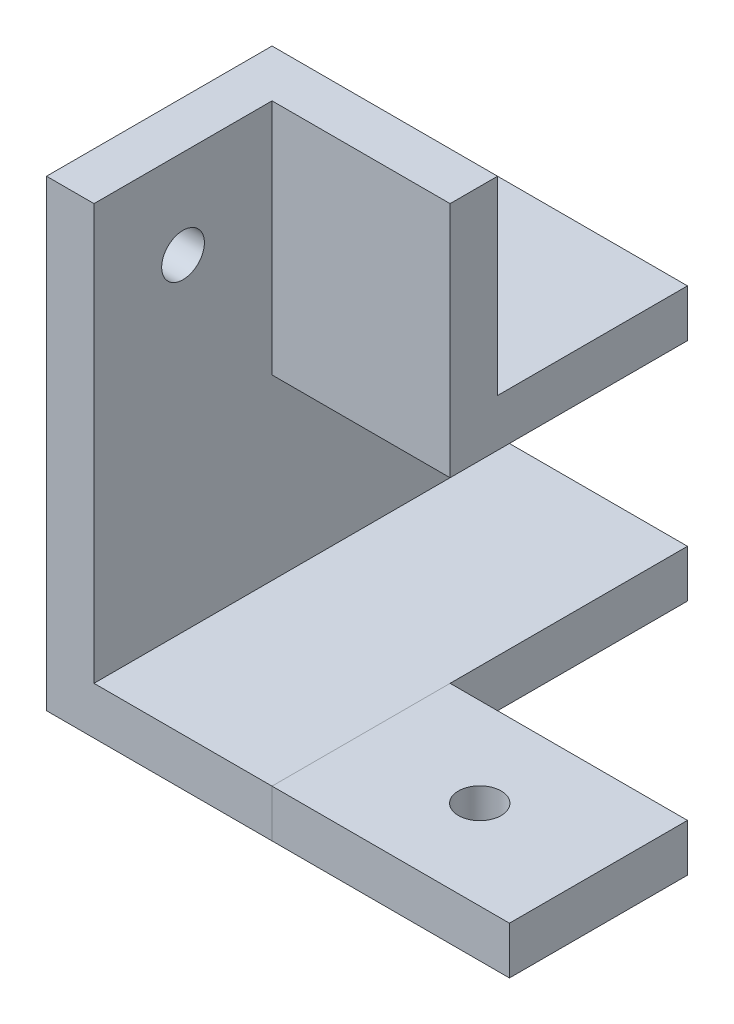
ISO-10303-21;
HEADER;
FILE_DESCRIPTION(('STEP AP214'),'2;1');
FILE_NAME('part.step','',(''),(''),'','','');
FILE_SCHEMA(('AUTOMOTIVE_DESIGN { 1 0 10303 214 1 1 1 1 }'));
ENDSEC;
DATA;
#1=APPLICATION_CONTEXT('core data for automotive mechanical design processes');
#2=APPLICATION_PROTOCOL_DEFINITION('international standard','automotive_design',2000,#1);
#3=PRODUCT_CONTEXT('',#1,'mechanical');
#4=PRODUCT('Part','Part','',(#3));
#5=PRODUCT_RELATED_PRODUCT_CATEGORY('part','',(#4));
#6=PRODUCT_DEFINITION_FORMATION('','',#4);
#7=PRODUCT_DEFINITION_CONTEXT('part definition',#1,'design');
#8=PRODUCT_DEFINITION('design','',#6,#7);
#9=PRODUCT_DEFINITION_SHAPE('','',#8);
#10=(LENGTH_UNIT() NAMED_UNIT(*) SI_UNIT(.MILLI.,.METRE.));
#11=(NAMED_UNIT(*) PLANE_ANGLE_UNIT() SI_UNIT($,.RADIAN.));
#12=(NAMED_UNIT(*) SI_UNIT($,.STERADIAN.) SOLID_ANGLE_UNIT());
#13=UNCERTAINTY_MEASURE_WITH_UNIT(LENGTH_MEASURE(1.E-05),#10,'distance_accuracy_value','');
#14=(GEOMETRIC_REPRESENTATION_CONTEXT(3) GLOBAL_UNCERTAINTY_ASSIGNED_CONTEXT((#13)) GLOBAL_UNIT_ASSIGNED_CONTEXT((#10,
#11,#12)) REPRESENTATION_CONTEXT('',''));
#15=CARTESIAN_POINT('',(0.,0.,0.));
#16=DIRECTION('',(0.,0.,1.));
#17=DIRECTION('',(1.,0.,0.));
#18=AXIS2_PLACEMENT_3D('',#15,#16,#17);
#19=CARTESIAN_POINT('',(35.,0.,0.));
#20=DIRECTION('',(0.,1.,0.));
#21=DIRECTION('',(0.,0.,1.));
#22=AXIS2_PLACEMENT_3D('',#19,#20,#21);
#23=PLANE('',#22);
#24=CARTESIAN_POINT('',(25.,0.,7.5));
#25=DIRECTION('',(0.,-1.,0.));
#26=DIRECTION('',(0.,0.,-1.));
#27=AXIS2_PLACEMENT_3D('',#24,#25,#26);
#28=CIRCLE('',#27,1.8);
#29=CARTESIAN_POINT('',(25.,0.,5.7));
#30=VERTEX_POINT('',#29);
#31=EDGE_CURVE('E106',#30,#30,#28,.T.);
#32=ORIENTED_EDGE('',*,*,#31,.F.);
#33=EDGE_LOOP('',(#32));
#34=FACE_BOUND('',#33,.T.);
#35=DIRECTION('',(0.,0.,-1.));
#36=VECTOR('',#35,1.);
#37=CARTESIAN_POINT('',(35.,0.,0.));
#38=LINE('',#37,#36);
#39=CARTESIAN_POINT('',(35.,0.,15.));
#40=VERTEX_POINT('',#39);
#41=CARTESIAN_POINT('',(35.,0.,0.));
#42=VERTEX_POINT('',#41);
#43=EDGE_CURVE('E95',#40,#42,#38,.T.);
#44=ORIENTED_EDGE('',*,*,#43,.F.);
#45=DIRECTION('',(1.,0.,0.));
#46=VECTOR('',#45,1.);
#47=CARTESIAN_POINT('',(35.,0.,15.));
#48=LINE('',#47,#46);
#49=CARTESIAN_POINT('',(15.,0.,15.));
#50=VERTEX_POINT('',#49);
#51=EDGE_CURVE('E85',#50,#40,#48,.T.);
#52=ORIENTED_EDGE('',*,*,#51,.F.);
#53=DIRECTION('',(0.,0.,-1.));
#54=VECTOR('',#53,1.);
#55=CARTESIAN_POINT('',(15.,0.,0.));
#56=LINE('',#55,#54);
#57=CARTESIAN_POINT('',(15.,0.,0.));
#58=VERTEX_POINT('',#57);
#59=EDGE_CURVE('E68',#50,#58,#56,.T.);
#60=ORIENTED_EDGE('',*,*,#59,.T.);
#61=DIRECTION('',(1.,0.,0.));
#62=VECTOR('',#61,1.);
#63=CARTESIAN_POINT('',(15.,0.,0.));
#64=LINE('',#63,#62);
#65=EDGE_CURVE('E99',#58,#42,#64,.T.);
#66=ORIENTED_EDGE('',*,*,#65,.T.);
#67=EDGE_LOOP('',(#44,#52,#60,#66));
#68=FACE_BOUND('',#67,.T.);
#69=ADVANCED_FACE('F47',(#34,#68),#23,.F.);
#70=CARTESIAN_POINT('',(35.,4.,0.));
#71=DIRECTION('',(0.,-1.,0.));
#72=DIRECTION('',(0.,0.,-1.));
#73=AXIS2_PLACEMENT_3D('',#70,#71,#72);
#74=PLANE('',#73);
#75=CARTESIAN_POINT('',(25.,4.,7.5));
#76=DIRECTION('',(0.,-1.,0.));
#77=DIRECTION('',(0.,0.,-1.));
#78=AXIS2_PLACEMENT_3D('',#75,#76,#77);
#79=CIRCLE('',#78,1.8);
#80=CARTESIAN_POINT('',(25.,4.,5.7));
#81=VERTEX_POINT('',#80);
#82=EDGE_CURVE('E109',#81,#81,#79,.T.);
#83=ORIENTED_EDGE('',*,*,#82,.T.);
#84=EDGE_LOOP('',(#83));
#85=FACE_BOUND('',#84,.T.);
#86=DIRECTION('',(0.,0.,1.));
#87=VECTOR('',#86,1.);
#88=CARTESIAN_POINT('',(15.,4.,0.));
#89=LINE('',#88,#87);
#90=CARTESIAN_POINT('',(15.,4.,0.));
#91=VERTEX_POINT('',#90);
#92=CARTESIAN_POINT('',(15.,4.,15.));
#93=VERTEX_POINT('',#92);
#94=EDGE_CURVE('E100',#91,#93,#89,.T.);
#95=ORIENTED_EDGE('',*,*,#94,.T.);
#96=DIRECTION('',(-1.,0.,0.));
#97=VECTOR('',#96,1.);
#98=CARTESIAN_POINT('',(15.,4.,15.));
#99=LINE('',#98,#97);
#100=CARTESIAN_POINT('',(35.,4.,15.));
#101=VERTEX_POINT('',#100);
#102=EDGE_CURVE('E61',#101,#93,#99,.T.);
#103=ORIENTED_EDGE('',*,*,#102,.F.);
#104=DIRECTION('',(0.,0.,1.));
#105=VECTOR('',#104,1.);
#106=CARTESIAN_POINT('',(35.,4.,0.));
#107=LINE('',#106,#105);
#108=CARTESIAN_POINT('',(35.,4.,0.));
#109=VERTEX_POINT('',#108);
#110=EDGE_CURVE('E54',#109,#101,#107,.T.);
#111=ORIENTED_EDGE('',*,*,#110,.F.);
#112=DIRECTION('',(1.,0.,0.));
#113=VECTOR('',#112,1.);
#114=CARTESIAN_POINT('',(15.,4.,0.));
#115=LINE('',#114,#113);
#116=EDGE_CURVE('E116',#91,#109,#115,.T.);
#117=ORIENTED_EDGE('',*,*,#116,.F.);
#118=EDGE_LOOP('',(#95,#103,#111,#117));
#119=FACE_BOUND('',#118,.T.);
#120=ADVANCED_FACE('F131',(#85,#119),#74,.F.);
#121=CARTESIAN_POINT('',(35.,0.,0.));
#122=DIRECTION('',(1.,0.,0.));
#123=DIRECTION('',(0.,0.,-1.));
#124=AXIS2_PLACEMENT_3D('',#121,#122,#123);
#125=PLANE('',#124);
#126=DIRECTION('',(0.,1.,0.));
#127=VECTOR('',#126,1.);
#128=CARTESIAN_POINT('',(35.,4.,15.));
#129=LINE('',#128,#127);
#130=EDGE_CURVE('E88',#40,#101,#129,.T.);
#131=ORIENTED_EDGE('',*,*,#130,.F.);
#132=ORIENTED_EDGE('',*,*,#43,.T.);
#133=DIRECTION('',(0.,-1.,0.));
#134=VECTOR('',#133,1.);
#135=CARTESIAN_POINT('',(35.,4.,0.));
#136=LINE('',#135,#134);
#137=EDGE_CURVE('E120',#109,#42,#136,.T.);
#138=ORIENTED_EDGE('',*,*,#137,.F.);
#139=ORIENTED_EDGE('',*,*,#110,.T.);
#140=EDGE_LOOP('',(#131,#132,#138,#139));
#141=FACE_BOUND('',#140,.T.);
#142=ADVANCED_FACE('F93',(#141),#125,.T.);
#143=CARTESIAN_POINT('',(15.,0.,0.));
#144=DIRECTION('',(1.,0.,0.));
#145=DIRECTION('',(0.,0.,-1.));
#146=AXIS2_PLACEMENT_3D('',#143,#144,#145);
#147=PLANE('',#146);
#148=ORIENTED_EDGE('',*,*,#59,.F.);
#149=DIRECTION('',(0.,1.,0.));
#150=VECTOR('',#149,1.);
#151=CARTESIAN_POINT('',(15.,0.,15.));
#152=LINE('',#151,#150);
#153=EDGE_CURVE('E12',#50,#93,#152,.T.);
#154=ORIENTED_EDGE('',*,*,#153,.T.);
#155=ORIENTED_EDGE('',*,*,#94,.F.);
#156=DIRECTION('',(0.,-1.,0.));
#157=VECTOR('',#156,1.);
#158=CARTESIAN_POINT('',(15.,4.,0.));
#159=LINE('',#158,#157);
#160=EDGE_CURVE('E118',#91,#58,#159,.T.);
#161=ORIENTED_EDGE('',*,*,#160,.T.);
#162=EDGE_LOOP('',(#148,#154,#155,#161));
#163=FACE_BOUND('',#162,.T.);
#164=ADVANCED_FACE('F126',(#163),#147,.F.);
#165=CARTESIAN_POINT('',(25.,12.,7.5));
#166=DIRECTION('',(0.,-1.,0.));
#167=DIRECTION('',(0.,0.,-1.));
#168=AXIS2_PLACEMENT_3D('',#165,#166,#167);
#169=CYLINDRICAL_SURFACE('',#168,1.8);
#170=ORIENTED_EDGE('',*,*,#31,.T.);
#171=EDGE_LOOP('',(#170));
#172=FACE_BOUND('',#171,.T.);
#173=ORIENTED_EDGE('',*,*,#82,.F.);
#174=EDGE_LOOP('',(#173));
#175=FACE_BOUND('',#174,.T.);
#176=ADVANCED_FACE('F141',(#172,#175),#169,.F.);
#177=CARTESIAN_POINT('',(15.,4.,0.));
#178=DIRECTION('',(0.,0.,1.));
#179=DIRECTION('',(1.,0.,0.));
#180=AXIS2_PLACEMENT_3D('',#177,#178,#179);
#181=PLANE('',#180);
#182=ORIENTED_EDGE('',*,*,#137,.T.);
#183=ORIENTED_EDGE('',*,*,#65,.F.);
#184=ORIENTED_EDGE('',*,*,#160,.F.);
#185=ORIENTED_EDGE('',*,*,#116,.T.);
#186=EDGE_LOOP('',(#182,#183,#184,#185));
#187=FACE_BOUND('',#186,.T.);
#188=ADVANCED_FACE('F129',(#187),#181,.F.);
#189=CARTESIAN_POINT('',(0.,0.,15.));
#190=DIRECTION('',(0.,0.,-1.));
#191=DIRECTION('',(-1.,0.,0.));
#192=AXIS2_PLACEMENT_3D('',#189,#190,#191);
#193=PLANE('',#192);
#194=ORIENTED_EDGE('',*,*,#51,.T.);
#195=ORIENTED_EDGE('',*,*,#130,.T.);
#196=ORIENTED_EDGE('',*,*,#102,.T.);
#197=ORIENTED_EDGE('',*,*,#153,.F.);
#198=EDGE_LOOP('',(#194,#195,#196,#197));
#199=FACE_BOUND('',#198,.T.);
#200=ADVANCED_FACE('F87',(#199),#193,.F.);
#201=CLOSED_SHELL('',(#69,#120,#142,#164,#176,#188,#200));
#202=MANIFOLD_SOLID_BREP('B2',#201);
#203=CARTESIAN_POINT('',(0.,0.,0.));
#204=DIRECTION('',(0.,0.,-1.));
#205=DIRECTION('',(-1.,0.,0.));
#206=AXIS2_PLACEMENT_3D('',#203,#204,#205);
#207=PLANE('',#206);
#208=DIRECTION('',(0.,-1.,0.));
#209=VECTOR('',#208,1.);
#210=CARTESIAN_POINT('',(0.,39.,0.));
#211=LINE('',#210,#209);
#212=CARTESIAN_POINT('',(0.,39.,0.));
#213=VERTEX_POINT('',#212);
#214=CARTESIAN_POINT('',(0.,19.,0.));
#215=VERTEX_POINT('',#214);
#216=EDGE_CURVE('E243',#213,#215,#211,.T.);
#217=ORIENTED_EDGE('',*,*,#216,.T.);
#218=DIRECTION('',(1.,0.,0.));
#219=VECTOR('',#218,1.);
#220=CARTESIAN_POINT('',(0.,19.,0.));
#221=LINE('',#220,#219);
#222=CARTESIAN_POINT('',(15.,19.,0.));
#223=VERTEX_POINT('',#222);
#224=EDGE_CURVE('E355',#215,#223,#221,.T.);
#225=ORIENTED_EDGE('',*,*,#224,.T.);
#226=DIRECTION('',(0.,1.,0.));
#227=VECTOR('',#226,1.);
#228=CARTESIAN_POINT('',(15.,0.,0.));
#229=LINE('',#228,#227);
#230=CARTESIAN_POINT('',(15.,39.,0.));
#231=VERTEX_POINT('',#230);
#232=EDGE_CURVE('E359',#223,#231,#229,.T.);
#233=ORIENTED_EDGE('',*,*,#232,.T.);
#234=DIRECTION('',(1.,0.,0.));
#235=VECTOR('',#234,1.);
#236=CARTESIAN_POINT('',(-3.99999999999999,39.,0.));
#237=LINE('',#236,#235);
#238=EDGE_CURVE('E392',#213,#231,#237,.T.);
#239=ORIENTED_EDGE('',*,*,#238,.F.);
#240=EDGE_LOOP('',(#217,#225,#233,#239));
#241=FACE_BOUND('',#240,.T.);
#242=ADVANCED_FACE('F228',(#241),#207,.F.);
#243=CARTESIAN_POINT('',(0.,23.,-20.));
#244=DIRECTION('',(0.,-1.,0.));
#245=DIRECTION('',(1.,0.,0.));
#246=AXIS2_PLACEMENT_3D('',#243,#244,#245);
#247=PLANE('',#246);
#248=DIRECTION('',(-1.,0.,0.));
#249=VECTOR('',#248,1.);
#250=CARTESIAN_POINT('',(-4.,23.,-4.));
#251=LINE('',#250,#249);
#252=CARTESIAN_POINT('',(15.,23.,-4.));
#253=VERTEX_POINT('',#252);
#254=CARTESIAN_POINT('',(-4.,23.,-4.));
#255=VERTEX_POINT('',#254);
#256=EDGE_CURVE('E251',#253,#255,#251,.T.);
#257=ORIENTED_EDGE('',*,*,#256,.F.);
#258=DIRECTION('',(0.,0.,1.));
#259=VECTOR('',#258,1.);
#260=CARTESIAN_POINT('',(15.,23.,-20.));
#261=LINE('',#260,#259);
#262=CARTESIAN_POINT('',(15.,23.,-20.));
#263=VERTEX_POINT('',#262);
#264=EDGE_CURVE('E352',#263,#253,#261,.T.);
#265=ORIENTED_EDGE('',*,*,#264,.F.);
#266=DIRECTION('',(1.,0.,0.));
#267=VECTOR('',#266,1.);
#268=CARTESIAN_POINT('',(0.,23.,-20.));
#269=LINE('',#268,#267);
#270=CARTESIAN_POINT('',(-4.,23.,-20.));
#271=VERTEX_POINT('',#270);
#272=EDGE_CURVE('E354',#271,#263,#269,.T.);
#273=ORIENTED_EDGE('',*,*,#272,.F.);
#274=DIRECTION('',(0.,0.,1.));
#275=VECTOR('',#274,1.);
#276=CARTESIAN_POINT('',(-4.,23.,-20.));
#277=LINE('',#276,#275);
#278=EDGE_CURVE('E350',#271,#255,#277,.T.);
#279=ORIENTED_EDGE('',*,*,#278,.T.);
#280=EDGE_LOOP('',(#257,#265,#273,#279));
#281=FACE_BOUND('',#280,.T.);
#282=ADVANCED_FACE('F434',(#281),#247,.F.);
#283=CARTESIAN_POINT('',(0.,0.,15.));
#284=DIRECTION('',(1.,0.,0.));
#285=DIRECTION('',(0.,1.,0.));
#286=AXIS2_PLACEMENT_3D('',#283,#284,#285);
#287=PLANE('',#286);
#288=CARTESIAN_POINT('',(0.,31.5,7.5));
#289=DIRECTION('',(1.,0.,0.));
#290=DIRECTION('',(0.,1.,0.));
#291=AXIS2_PLACEMENT_3D('',#288,#289,#290);
#292=CIRCLE('',#291,1.8);
#293=CARTESIAN_POINT('',(0.,33.3,7.5));
#294=VERTEX_POINT('',#293);
#295=EDGE_CURVE('E398',#294,#294,#292,.T.);
#296=ORIENTED_EDGE('',*,*,#295,.F.);
#297=EDGE_LOOP('',(#296));
#298=FACE_BOUND('',#297,.T.);
#299=CARTESIAN_POINT('',(0.,10.5,-12.5));
#300=DIRECTION('',(1.,0.,0.));
#301=DIRECTION('',(0.,1.,0.));
#302=AXIS2_PLACEMENT_3D('',#299,#300,#301);
#303=CIRCLE('',#302,1.8);
#304=CARTESIAN_POINT('',(0.,12.3,-12.5));
#305=VERTEX_POINT('',#304);
#306=EDGE_CURVE('E401',#305,#305,#303,.T.);
#307=ORIENTED_EDGE('',*,*,#306,.F.);
#308=EDGE_LOOP('',(#307));
#309=FACE_BOUND('',#308,.T.);
#310=DIRECTION('',(0.,0.,-1.));
#311=VECTOR('',#310,1.);
#312=CARTESIAN_POINT('',(0.,4.,15.));
#313=LINE('',#312,#311);
#314=CARTESIAN_POINT('',(0.,4.,15.));
#315=VERTEX_POINT('',#314);
#316=CARTESIAN_POINT('',(0.,4.,-20.));
#317=VERTEX_POINT('',#316);
#318=EDGE_CURVE('E338',#315,#317,#313,.T.);
#319=ORIENTED_EDGE('',*,*,#318,.T.);
#320=DIRECTION('',(0.,-1.,0.));
#321=VECTOR('',#320,1.);
#322=CARTESIAN_POINT('',(0.,0.,-20.));
#323=LINE('',#322,#321);
#324=CARTESIAN_POINT('',(0.,19.,-20.));
#325=VERTEX_POINT('',#324);
#326=EDGE_CURVE('E373',#325,#317,#323,.T.);
#327=ORIENTED_EDGE('',*,*,#326,.F.);
#328=DIRECTION('',(0.,0.,1.));
#329=VECTOR('',#328,1.);
#330=CARTESIAN_POINT('',(0.,19.,-20.));
#331=LINE('',#330,#329);
#332=EDGE_CURVE('E348',#325,#215,#331,.T.);
#333=ORIENTED_EDGE('',*,*,#332,.T.);
#334=ORIENTED_EDGE('',*,*,#216,.F.);
#335=DIRECTION('',(0.,0.,-1.));
#336=VECTOR('',#335,1.);
#337=CARTESIAN_POINT('',(0.,39.,0.));
#338=LINE('',#337,#336);
#339=CARTESIAN_POINT('',(0.,39.,15.));
#340=VERTEX_POINT('',#339);
#341=EDGE_CURVE('E396',#340,#213,#338,.T.);
#342=ORIENTED_EDGE('',*,*,#341,.F.);
#343=DIRECTION('',(0.,-1.,0.));
#344=VECTOR('',#343,1.);
#345=CARTESIAN_POINT('',(0.,0.,15.));
#346=LINE('',#345,#344);
#347=EDGE_CURVE('E343',#340,#315,#346,.T.);
#348=ORIENTED_EDGE('',*,*,#347,.T.);
#349=EDGE_LOOP('',(#319,#327,#333,#334,#342,#348));
#350=FACE_BOUND('',#349,.T.);
#351=ADVANCED_FACE('F230',(#298,#309,#350),#287,.T.);
#352=CARTESIAN_POINT('',(-4.,0.,15.));
#353=DIRECTION('',(1.,0.,0.));
#354=DIRECTION('',(0.,1.,0.));
#355=AXIS2_PLACEMENT_3D('',#352,#353,#354);
#356=PLANE('',#355);
#357=CARTESIAN_POINT('',(-4.,31.5,7.5));
#358=DIRECTION('',(-1.,0.,0.));
#359=DIRECTION('',(0.,-1.,0.));
#360=AXIS2_PLACEMENT_3D('',#357,#358,#359);
#361=CIRCLE('',#360,1.8);
#362=CARTESIAN_POINT('',(-4.,29.7,7.5));
#363=VERTEX_POINT('',#362);
#364=EDGE_CURVE('E404',#363,#363,#361,.T.);
#365=ORIENTED_EDGE('',*,*,#364,.F.);
#366=EDGE_LOOP('',(#365));
#367=FACE_BOUND('',#366,.T.);
#368=CARTESIAN_POINT('',(-4.,10.5,-12.5));
#369=DIRECTION('',(-1.,0.,0.));
#370=DIRECTION('',(0.,-1.,0.));
#371=AXIS2_PLACEMENT_3D('',#368,#369,#370);
#372=CIRCLE('',#371,1.8);
#373=CARTESIAN_POINT('',(-4.,8.7,-12.5));
#374=VERTEX_POINT('',#373);
#375=EDGE_CURVE('E405',#374,#374,#372,.T.);
#376=ORIENTED_EDGE('',*,*,#375,.F.);
#377=EDGE_LOOP('',(#376));
#378=FACE_BOUND('',#377,.T.);
#379=DIRECTION('',(0.,0.,-1.));
#380=VECTOR('',#379,1.);
#381=CARTESIAN_POINT('',(-4.,0.,15.));
#382=LINE('',#381,#380);
#383=CARTESIAN_POINT('',(-4.,0.,15.));
#384=VERTEX_POINT('',#383);
#385=CARTESIAN_POINT('',(-4.,0.,-20.));
#386=VERTEX_POINT('',#385);
#387=EDGE_CURVE('E236',#384,#386,#382,.T.);
#388=ORIENTED_EDGE('',*,*,#387,.F.);
#389=DIRECTION('',(0.,-1.,0.));
#390=VECTOR('',#389,1.);
#391=CARTESIAN_POINT('',(-4.,0.,15.));
#392=LINE('',#391,#390);
#393=CARTESIAN_POINT('',(-4.,39.,15.));
#394=VERTEX_POINT('',#393);
#395=EDGE_CURVE('E312',#394,#384,#392,.T.);
#396=ORIENTED_EDGE('',*,*,#395,.F.);
#397=DIRECTION('',(0.,0.,1.));
#398=VECTOR('',#397,1.);
#399=CARTESIAN_POINT('',(-3.99999999999999,39.,0.));
#400=LINE('',#399,#398);
#401=CARTESIAN_POINT('',(-3.99999999999999,39.,-4.));
#402=VERTEX_POINT('',#401);
#403=EDGE_CURVE('E388',#402,#394,#400,.T.);
#404=ORIENTED_EDGE('',*,*,#403,.F.);
#405=DIRECTION('',(0.,-1.,0.));
#406=VECTOR('',#405,1.);
#407=CARTESIAN_POINT('',(-3.99999999999999,39.,-4.));
#408=LINE('',#407,#406);
#409=EDGE_CURVE('E383',#402,#255,#408,.T.);
#410=ORIENTED_EDGE('',*,*,#409,.T.);
#411=ORIENTED_EDGE('',*,*,#278,.F.);
#412=DIRECTION('',(0.,1.,0.));
#413=VECTOR('',#412,1.);
#414=CARTESIAN_POINT('',(-4.,0.,-20.));
#415=LINE('',#414,#413);
#416=EDGE_CURVE('E333',#386,#271,#415,.T.);
#417=ORIENTED_EDGE('',*,*,#416,.F.);
#418=EDGE_LOOP('',(#388,#396,#404,#410,#411,#417));
#419=FACE_BOUND('',#418,.T.);
#420=ADVANCED_FACE('F331',(#367,#378,#419),#356,.F.);
#421=CARTESIAN_POINT('',(0.,0.,15.));
#422=DIRECTION('',(0.,1.,0.));
#423=DIRECTION('',(0.,0.,1.));
#424=AXIS2_PLACEMENT_3D('',#421,#422,#423);
#425=PLANE('',#424);
#426=DIRECTION('',(0.,0.,-1.));
#427=VECTOR('',#426,1.);
#428=CARTESIAN_POINT('',(15.,0.,15.));
#429=LINE('',#428,#427);
#430=CARTESIAN_POINT('',(15.,0.,15.));
#431=VERTEX_POINT('',#430);
#432=CARTESIAN_POINT('',(15.,0.,-20.));
#433=VERTEX_POINT('',#432);
#434=EDGE_CURVE('E327',#431,#433,#429,.T.);
#435=ORIENTED_EDGE('',*,*,#434,.F.);
#436=DIRECTION('',(1.,0.,0.));
#437=VECTOR('',#436,1.);
#438=CARTESIAN_POINT('',(35.,0.,15.));
#439=LINE('',#438,#437);
#440=EDGE_CURVE('E315',#384,#431,#439,.T.);
#441=ORIENTED_EDGE('',*,*,#440,.F.);
#442=ORIENTED_EDGE('',*,*,#387,.T.);
#443=DIRECTION('',(-1.,0.,0.));
#444=VECTOR('',#443,1.);
#445=CARTESIAN_POINT('',(0.,0.,-20.));
#446=LINE('',#445,#444);
#447=EDGE_CURVE('E365',#433,#386,#446,.T.);
#448=ORIENTED_EDGE('',*,*,#447,.F.);
#449=EDGE_LOOP('',(#435,#441,#442,#448));
#450=FACE_BOUND('',#449,.T.);
#451=ADVANCED_FACE('F324',(#450),#425,.F.);
#452=CARTESIAN_POINT('',(15.,0.,15.));
#453=DIRECTION('',(-1.,0.,0.));
#454=DIRECTION('',(0.,0.,1.));
#455=AXIS2_PLACEMENT_3D('',#452,#453,#454);
#456=PLANE('',#455);
#457=DIRECTION('',(0.,0.,-1.));
#458=VECTOR('',#457,1.);
#459=CARTESIAN_POINT('',(15.,4.,15.));
#460=LINE('',#459,#458);
#461=CARTESIAN_POINT('',(15.,4.,15.));
#462=VERTEX_POINT('',#461);
#463=CARTESIAN_POINT('',(15.,4.,-20.));
#464=VERTEX_POINT('',#463);
#465=EDGE_CURVE('E334',#462,#464,#460,.T.);
#466=ORIENTED_EDGE('',*,*,#465,.F.);
#467=DIRECTION('',(0.,-1.,0.));
#468=VECTOR('',#467,1.);
#469=CARTESIAN_POINT('',(15.,0.,15.));
#470=LINE('',#469,#468);
#471=EDGE_CURVE('E328',#462,#431,#470,.T.);
#472=ORIENTED_EDGE('',*,*,#471,.T.);
#473=ORIENTED_EDGE('',*,*,#434,.T.);
#474=DIRECTION('',(0.,-1.,0.));
#475=VECTOR('',#474,1.);
#476=CARTESIAN_POINT('',(15.,0.,-20.));
#477=LINE('',#476,#475);
#478=EDGE_CURVE('E367',#464,#433,#477,.T.);
#479=ORIENTED_EDGE('',*,*,#478,.F.);
#480=EDGE_LOOP('',(#466,#472,#473,#479));
#481=FACE_BOUND('',#480,.T.);
#482=ADVANCED_FACE('F412',(#481),#456,.F.);
#483=CARTESIAN_POINT('',(0.,4.,15.));
#484=DIRECTION('',(0.,1.,0.));
#485=DIRECTION('',(0.,0.,1.));
#486=AXIS2_PLACEMENT_3D('',#483,#484,#485);
#487=PLANE('',#486);
#488=ORIENTED_EDGE('',*,*,#465,.T.);
#489=DIRECTION('',(1.,0.,0.));
#490=VECTOR('',#489,1.);
#491=CARTESIAN_POINT('',(0.,4.,-20.));
#492=LINE('',#491,#490);
#493=EDGE_CURVE('E370',#317,#464,#492,.T.);
#494=ORIENTED_EDGE('',*,*,#493,.F.);
#495=ORIENTED_EDGE('',*,*,#318,.F.);
#496=DIRECTION('',(1.,0.,0.));
#497=VECTOR('',#496,1.);
#498=CARTESIAN_POINT('',(0.,4.,15.));
#499=LINE('',#498,#497);
#500=EDGE_CURVE('E340',#315,#462,#499,.T.);
#501=ORIENTED_EDGE('',*,*,#500,.T.);
#502=EDGE_LOOP('',(#488,#494,#495,#501));
#503=FACE_BOUND('',#502,.T.);
#504=ADVANCED_FACE('F417',(#503),#487,.T.);
#505=CARTESIAN_POINT('',(15.,0.,-20.));
#506=DIRECTION('',(1.,0.,0.));
#507=DIRECTION('',(0.,0.,-1.));
#508=AXIS2_PLACEMENT_3D('',#505,#506,#507);
#509=PLANE('',#508);
#510=ORIENTED_EDGE('',*,*,#232,.F.);
#511=DIRECTION('',(0.,0.,1.));
#512=VECTOR('',#511,1.);
#513=CARTESIAN_POINT('',(15.,19.,-20.));
#514=LINE('',#513,#512);
#515=CARTESIAN_POINT('',(15.,19.,-20.));
#516=VERTEX_POINT('',#515);
#517=EDGE_CURVE('E346',#516,#223,#514,.T.);
#518=ORIENTED_EDGE('',*,*,#517,.F.);
#519=DIRECTION('',(0.,1.,0.));
#520=VECTOR('',#519,1.);
#521=CARTESIAN_POINT('',(15.,0.,-20.));
#522=LINE('',#521,#520);
#523=EDGE_CURVE('E358',#516,#263,#522,.T.);
#524=ORIENTED_EDGE('',*,*,#523,.T.);
#525=ORIENTED_EDGE('',*,*,#264,.T.);
#526=DIRECTION('',(0.,-1.,0.));
#527=VECTOR('',#526,1.);
#528=CARTESIAN_POINT('',(15.,39.,-4.));
#529=LINE('',#528,#527);
#530=CARTESIAN_POINT('',(15.,39.,-4.));
#531=VERTEX_POINT('',#530);
#532=EDGE_CURVE('E362',#531,#253,#529,.T.);
#533=ORIENTED_EDGE('',*,*,#532,.F.);
#534=DIRECTION('',(0.,0.,-1.));
#535=VECTOR('',#534,1.);
#536=CARTESIAN_POINT('',(15.,39.,0.));
#537=LINE('',#536,#535);
#538=EDGE_CURVE('E390',#231,#531,#537,.T.);
#539=ORIENTED_EDGE('',*,*,#538,.F.);
#540=EDGE_LOOP('',(#510,#518,#524,#525,#533,#539));
#541=FACE_BOUND('',#540,.T.);
#542=ADVANCED_FACE('F428',(#541),#509,.T.);
#543=CARTESIAN_POINT('',(0.,19.,-20.));
#544=DIRECTION('',(0.,-1.,0.));
#545=DIRECTION('',(1.,0.,0.));
#546=AXIS2_PLACEMENT_3D('',#543,#544,#545);
#547=PLANE('',#546);
#548=ORIENTED_EDGE('',*,*,#224,.F.);
#549=ORIENTED_EDGE('',*,*,#332,.F.);
#550=DIRECTION('',(1.,0.,0.));
#551=VECTOR('',#550,1.);
#552=CARTESIAN_POINT('',(0.,19.,-20.));
#553=LINE('',#552,#551);
#554=EDGE_CURVE('E376',#325,#516,#553,.T.);
#555=ORIENTED_EDGE('',*,*,#554,.T.);
#556=ORIENTED_EDGE('',*,*,#517,.T.);
#557=EDGE_LOOP('',(#548,#549,#555,#556));
#558=FACE_BOUND('',#557,.T.);
#559=ADVANCED_FACE('F440',(#558),#547,.T.);
#560=CARTESIAN_POINT('',(0.,0.,-20.));
#561=DIRECTION('',(0.,0.,-1.));
#562=DIRECTION('',(-1.,0.,0.));
#563=AXIS2_PLACEMENT_3D('',#560,#561,#562);
#564=PLANE('',#563);
#565=ORIENTED_EDGE('',*,*,#523,.F.);
#566=ORIENTED_EDGE('',*,*,#554,.F.);
#567=ORIENTED_EDGE('',*,*,#326,.T.);
#568=ORIENTED_EDGE('',*,*,#493,.T.);
#569=ORIENTED_EDGE('',*,*,#478,.T.);
#570=ORIENTED_EDGE('',*,*,#447,.T.);
#571=ORIENTED_EDGE('',*,*,#416,.T.);
#572=ORIENTED_EDGE('',*,*,#272,.T.);
#573=EDGE_LOOP('',(#565,#566,#567,#568,#569,#570,#571,#572));
#574=FACE_BOUND('',#573,.T.);
#575=ADVANCED_FACE('F437',(#574),#564,.T.);
#576=CARTESIAN_POINT('',(-3.99999999999999,39.,-4.));
#577=DIRECTION('',(0.,0.,1.));
#578=DIRECTION('',(1.,0.,0.));
#579=AXIS2_PLACEMENT_3D('',#576,#577,#578);
#580=PLANE('',#579);
#581=ORIENTED_EDGE('',*,*,#256,.T.);
#582=ORIENTED_EDGE('',*,*,#409,.F.);
#583=DIRECTION('',(-1.,0.,0.));
#584=VECTOR('',#583,1.);
#585=CARTESIAN_POINT('',(-3.99999999999999,39.,-4.));
#586=LINE('',#585,#584);
#587=EDGE_CURVE('E386',#531,#402,#586,.T.);
#588=ORIENTED_EDGE('',*,*,#587,.F.);
#589=ORIENTED_EDGE('',*,*,#532,.T.);
#590=EDGE_LOOP('',(#581,#582,#588,#589));
#591=FACE_BOUND('',#590,.T.);
#592=ADVANCED_FACE('F432',(#591),#580,.F.);
#593=CARTESIAN_POINT('',(0.,39.,0.));
#594=DIRECTION('',(0.,-1.,0.));
#595=DIRECTION('',(1.,0.,0.));
#596=AXIS2_PLACEMENT_3D('',#593,#594,#595);
#597=PLANE('',#596);
#598=ORIENTED_EDGE('',*,*,#403,.T.);
#599=DIRECTION('',(1.,0.,0.));
#600=VECTOR('',#599,1.);
#601=CARTESIAN_POINT('',(0.,39.,15.));
#602=LINE('',#601,#600);
#603=EDGE_CURVE('E45',#394,#340,#602,.T.);
#604=ORIENTED_EDGE('',*,*,#603,.T.);
#605=ORIENTED_EDGE('',*,*,#341,.T.);
#606=ORIENTED_EDGE('',*,*,#238,.T.);
#607=ORIENTED_EDGE('',*,*,#538,.T.);
#608=ORIENTED_EDGE('',*,*,#587,.T.);
#609=EDGE_LOOP('',(#598,#604,#605,#606,#607,#608));
#610=FACE_BOUND('',#609,.T.);
#611=ADVANCED_FACE('F421',(#610),#597,.F.);
#612=CARTESIAN_POINT('',(8.,10.5,-12.5));
#613=DIRECTION('',(-1.,0.,0.));
#614=DIRECTION('',(0.,-1.,0.));
#615=AXIS2_PLACEMENT_3D('',#612,#613,#614);
#616=CYLINDRICAL_SURFACE('',#615,1.8);
#617=ORIENTED_EDGE('',*,*,#306,.T.);
#618=EDGE_LOOP('',(#617));
#619=FACE_BOUND('',#618,.T.);
#620=ORIENTED_EDGE('',*,*,#375,.T.);
#621=EDGE_LOOP('',(#620));
#622=FACE_BOUND('',#621,.T.);
#623=ADVANCED_FACE('F460',(#619,#622),#616,.F.);
#624=CARTESIAN_POINT('',(8.,31.5,7.5));
#625=DIRECTION('',(-1.,0.,0.));
#626=DIRECTION('',(0.,-1.,0.));
#627=AXIS2_PLACEMENT_3D('',#624,#625,#626);
#628=CYLINDRICAL_SURFACE('',#627,1.8);
#629=ORIENTED_EDGE('',*,*,#295,.T.);
#630=EDGE_LOOP('',(#629));
#631=FACE_BOUND('',#630,.T.);
#632=ORIENTED_EDGE('',*,*,#364,.T.);
#633=EDGE_LOOP('',(#632));
#634=FACE_BOUND('',#633,.T.);
#635=ADVANCED_FACE('F463',(#631,#634),#628,.F.);
#636=CARTESIAN_POINT('',(0.,0.,15.));
#637=DIRECTION('',(0.,0.,-1.));
#638=DIRECTION('',(-1.,0.,0.));
#639=AXIS2_PLACEMENT_3D('',#636,#637,#638);
#640=PLANE('',#639);
#641=ORIENTED_EDGE('',*,*,#347,.F.);
#642=ORIENTED_EDGE('',*,*,#603,.F.);
#643=ORIENTED_EDGE('',*,*,#395,.T.);
#644=ORIENTED_EDGE('',*,*,#440,.T.);
#645=ORIENTED_EDGE('',*,*,#471,.F.);
#646=ORIENTED_EDGE('',*,*,#500,.F.);
#647=EDGE_LOOP('',(#641,#642,#643,#644,#645,#646));
#648=FACE_BOUND('',#647,.T.);
#649=ADVANCED_FACE('F314',(#648),#640,.F.);
#650=CLOSED_SHELL('',(#242,#282,#351,#420,#451,#482,#504,#542,#559,#575,#592,#611,#623,#635,#649));
#651=MANIFOLD_SOLID_BREP('B6',#650);
#652=ADVANCED_BREP_SHAPE_REPRESENTATION('',(#18,#202,#651),#14);
#653=SHAPE_DEFINITION_REPRESENTATION(#9,#652);
ENDSEC;
END-ISO-10303-21;
